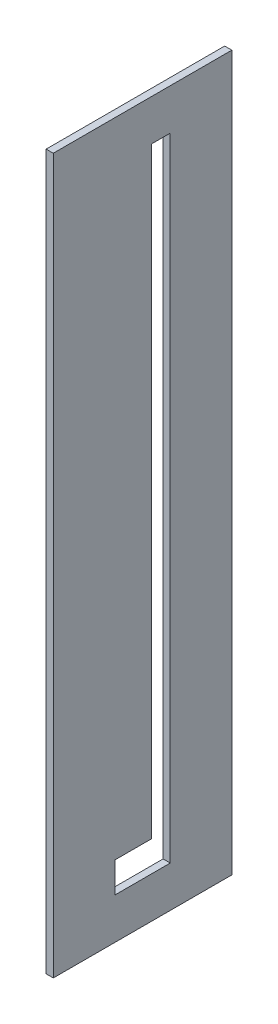
ISO-10303-21;
HEADER;
FILE_DESCRIPTION(('STEP AP214'),'2;1');
FILE_NAME('part.step','',(''),(''),'','','');
FILE_SCHEMA(('AUTOMOTIVE_DESIGN { 1 0 10303 214 1 1 1 1 }'));
ENDSEC;
DATA;
#1=APPLICATION_CONTEXT('core data for automotive mechanical design processes');
#2=APPLICATION_PROTOCOL_DEFINITION('international standard','automotive_design',2000,#1);
#3=PRODUCT_CONTEXT('',#1,'mechanical');
#4=PRODUCT('Part','Part','',(#3));
#5=PRODUCT_RELATED_PRODUCT_CATEGORY('part','',(#4));
#6=PRODUCT_DEFINITION_FORMATION('','',#4);
#7=PRODUCT_DEFINITION_CONTEXT('part definition',#1,'design');
#8=PRODUCT_DEFINITION('design','',#6,#7);
#9=PRODUCT_DEFINITION_SHAPE('','',#8);
#10=(LENGTH_UNIT() NAMED_UNIT(*) SI_UNIT(.MILLI.,.METRE.));
#11=(NAMED_UNIT(*) PLANE_ANGLE_UNIT() SI_UNIT($,.RADIAN.));
#12=(NAMED_UNIT(*) SI_UNIT($,.STERADIAN.) SOLID_ANGLE_UNIT());
#13=UNCERTAINTY_MEASURE_WITH_UNIT(LENGTH_MEASURE(1.E-05),#10,'distance_accuracy_value','');
#14=(GEOMETRIC_REPRESENTATION_CONTEXT(3) GLOBAL_UNCERTAINTY_ASSIGNED_CONTEXT((#13)) GLOBAL_UNIT_ASSIGNED_CONTEXT((#10,
#11,#12)) REPRESENTATION_CONTEXT('',''));
#15=CARTESIAN_POINT('',(0.,0.,0.));
#16=DIRECTION('',(0.,0.,1.));
#17=DIRECTION('',(1.,0.,0.));
#18=AXIS2_PLACEMENT_3D('',#15,#16,#17);
#19=CARTESIAN_POINT('',(4.,377.,15.5000000000001));
#20=DIRECTION('',(0.,0.,-1.));
#21=DIRECTION('',(0.,1.,0.));
#22=AXIS2_PLACEMENT_3D('',#19,#20,#21);
#23=PLANE('',#22);
#24=DIRECTION('',(0.,-1.,0.));
#25=VECTOR('',#24,1.);
#26=CARTESIAN_POINT('',(0.,377.,15.5000000000001));
#27=LINE('',#26,#25);
#28=CARTESIAN_POINT('',(0.,40.,15.5));
#29=VERTEX_POINT('',#28);
#30=CARTESIAN_POINT('',(0.,23.,15.5));
#31=VERTEX_POINT('',#30);
#32=EDGE_CURVE('E149',#29,#31,#27,.T.);
#33=ORIENTED_EDGE('',*,*,#32,.F.);
#34=DIRECTION('',(-1.,0.,0.));
#35=VECTOR('',#34,1.);
#36=CARTESIAN_POINT('',(4.,40.,15.5));
#37=LINE('',#36,#35);
#38=CARTESIAN_POINT('',(4.,40.,15.5));
#39=VERTEX_POINT('',#38);
#40=EDGE_CURVE('E138',#39,#29,#37,.T.);
#41=ORIENTED_EDGE('',*,*,#40,.F.);
#42=DIRECTION('',(0.,-1.,0.));
#43=VECTOR('',#42,1.);
#44=CARTESIAN_POINT('',(4.,377.,15.5000000000001));
#45=LINE('',#44,#43);
#46=CARTESIAN_POINT('',(4.,23.,15.5));
#47=VERTEX_POINT('',#46);
#48=EDGE_CURVE('E127',#39,#47,#45,.T.);
#49=ORIENTED_EDGE('',*,*,#48,.T.);
#50=DIRECTION('',(-1.,0.,0.));
#51=VECTOR('',#50,1.);
#52=CARTESIAN_POINT('',(4.,23.,15.5));
#53=LINE('',#52,#51);
#54=EDGE_CURVE('E171',#47,#31,#53,.T.);
#55=ORIENTED_EDGE('',*,*,#54,.T.);
#56=EDGE_LOOP('',(#33,#41,#49,#55));
#57=FACE_BOUND('',#56,.T.);
#58=ADVANCED_FACE('F33',(#57),#23,.T.);
#59=CARTESIAN_POINT('',(4.,377.,15.5000000000001));
#60=DIRECTION('',(0.,-1.,0.));
#61=DIRECTION('',(0.,0.,-1.));
#62=AXIS2_PLACEMENT_3D('',#59,#60,#61);
#63=PLANE('',#62);
#64=DIRECTION('',(0.,0.,1.));
#65=VECTOR('',#64,1.);
#66=CARTESIAN_POINT('',(4.,377.,15.5000000000001));
#67=LINE('',#66,#65);
#68=CARTESIAN_POINT('',(4.,377.,-15.4999999999999));
#69=VERTEX_POINT('',#68);
#70=CARTESIAN_POINT('',(4.,377.,-4.99999999999987));
#71=VERTEX_POINT('',#70);
#72=EDGE_CURVE('E157',#69,#71,#67,.T.);
#73=ORIENTED_EDGE('',*,*,#72,.T.);
#74=DIRECTION('',(-1.,0.,0.));
#75=VECTOR('',#74,1.);
#76=CARTESIAN_POINT('',(4.,377.,-4.99999999999987));
#77=LINE('',#76,#75);
#78=CARTESIAN_POINT('',(0.,377.,-4.99999999999987));
#79=VERTEX_POINT('',#78);
#80=EDGE_CURVE('E142',#71,#79,#77,.T.);
#81=ORIENTED_EDGE('',*,*,#80,.T.);
#82=DIRECTION('',(0.,0.,1.));
#83=VECTOR('',#82,1.);
#84=CARTESIAN_POINT('',(0.,377.,15.5000000000001));
#85=LINE('',#84,#83);
#86=CARTESIAN_POINT('',(0.,377.,-15.4999999999999));
#87=VERTEX_POINT('',#86);
#88=EDGE_CURVE('E153',#87,#79,#85,.T.);
#89=ORIENTED_EDGE('',*,*,#88,.F.);
#90=DIRECTION('',(-1.,0.,0.));
#91=VECTOR('',#90,1.);
#92=CARTESIAN_POINT('',(4.,377.,-15.4999999999999));
#93=LINE('',#92,#91);
#94=EDGE_CURVE('E48',#69,#87,#93,.T.);
#95=ORIENTED_EDGE('',*,*,#94,.F.);
#96=EDGE_LOOP('',(#73,#81,#89,#95));
#97=FACE_BOUND('',#96,.T.);
#98=ADVANCED_FACE('F218',(#97),#63,.T.);
#99=CARTESIAN_POINT('',(4.,0.,0.));
#100=DIRECTION('',(1.,0.,0.));
#101=DIRECTION('',(0.,0.,-1.));
#102=AXIS2_PLACEMENT_3D('',#99,#100,#101);
#103=PLANE('',#102);
#104=ORIENTED_EDGE('',*,*,#48,.F.);
#105=DIRECTION('',(0.,0.,-1.));
#106=VECTOR('',#105,1.);
#107=CARTESIAN_POINT('',(4.,40.,0.));
#108=LINE('',#107,#106);
#109=CARTESIAN_POINT('',(4.,40.,-4.99999999999987));
#110=VERTEX_POINT('',#109);
#111=EDGE_CURVE('E119',#39,#110,#108,.T.);
#112=ORIENTED_EDGE('',*,*,#111,.T.);
#113=DIRECTION('',(0.,1.,0.));
#114=VECTOR('',#113,1.);
#115=CARTESIAN_POINT('',(4.,0.,-4.99999999999987));
#116=LINE('',#115,#114);
#117=EDGE_CURVE('E124',#110,#71,#116,.T.);
#118=ORIENTED_EDGE('',*,*,#117,.T.);
#119=ORIENTED_EDGE('',*,*,#72,.F.);
#120=DIRECTION('',(0.,1.,0.));
#121=VECTOR('',#120,1.);
#122=CARTESIAN_POINT('',(4.,377.,-15.4999999999999));
#123=LINE('',#122,#121);
#124=CARTESIAN_POINT('',(4.,23.,-15.5));
#125=VERTEX_POINT('',#124);
#126=EDGE_CURVE('E155',#125,#69,#123,.T.);
#127=ORIENTED_EDGE('',*,*,#126,.F.);
#128=DIRECTION('',(0.,0.,-1.));
#129=VECTOR('',#128,1.);
#130=CARTESIAN_POINT('',(4.,23.,15.5));
#131=LINE('',#130,#129);
#132=EDGE_CURVE('E152',#47,#125,#131,.T.);
#133=ORIENTED_EDGE('',*,*,#132,.F.);
#134=EDGE_LOOP('',(#104,#112,#118,#119,#127,#133));
#135=FACE_BOUND('',#134,.T.);
#136=DIRECTION('',(0.,1.,0.));
#137=VECTOR('',#136,1.);
#138=CARTESIAN_POINT('',(4.,400.,-49.9999999999999));
#139=LINE('',#138,#137);
#140=CARTESIAN_POINT('',(4.,0.,-50.));
#141=VERTEX_POINT('',#140);
#142=CARTESIAN_POINT('',(4.,400.,-49.9999999999999));
#143=VERTEX_POINT('',#142);
#144=EDGE_CURVE('E175',#141,#143,#139,.T.);
#145=ORIENTED_EDGE('',*,*,#144,.T.);
#146=DIRECTION('',(0.,0.,1.));
#147=VECTOR('',#146,1.);
#148=CARTESIAN_POINT('',(4.,400.,50.));
#149=LINE('',#148,#147);
#150=CARTESIAN_POINT('',(4.,400.,50.));
#151=VERTEX_POINT('',#150);
#152=EDGE_CURVE('E85',#143,#151,#149,.T.);
#153=ORIENTED_EDGE('',*,*,#152,.T.);
#154=DIRECTION('',(0.,-1.,0.));
#155=VECTOR('',#154,1.);
#156=CARTESIAN_POINT('',(4.,0.,50.));
#157=LINE('',#156,#155);
#158=CARTESIAN_POINT('',(4.,0.,50.));
#159=VERTEX_POINT('',#158);
#160=EDGE_CURVE('E178',#151,#159,#157,.T.);
#161=ORIENTED_EDGE('',*,*,#160,.T.);
#162=DIRECTION('',(0.,0.,-1.));
#163=VECTOR('',#162,1.);
#164=CARTESIAN_POINT('',(4.,0.,50.));
#165=LINE('',#164,#163);
#166=EDGE_CURVE('E57',#159,#141,#165,.T.);
#167=ORIENTED_EDGE('',*,*,#166,.T.);
#168=EDGE_LOOP('',(#145,#153,#161,#167));
#169=FACE_BOUND('',#168,.T.);
#170=ADVANCED_FACE('F121',(#135,#169),#103,.T.);
#171=CARTESIAN_POINT('',(0.,0.,0.));
#172=DIRECTION('',(1.,0.,0.));
#173=DIRECTION('',(0.,0.,-1.));
#174=AXIS2_PLACEMENT_3D('',#171,#172,#173);
#175=PLANE('',#174);
#176=DIRECTION('',(0.,0.,-1.));
#177=VECTOR('',#176,1.);
#178=CARTESIAN_POINT('',(0.,40.,0.));
#179=LINE('',#178,#177);
#180=CARTESIAN_POINT('',(0.,40.,-4.99999999999987));
#181=VERTEX_POINT('',#180);
#182=EDGE_CURVE('E135',#29,#181,#179,.T.);
#183=ORIENTED_EDGE('',*,*,#182,.F.);
#184=ORIENTED_EDGE('',*,*,#32,.T.);
#185=DIRECTION('',(0.,0.,-1.));
#186=VECTOR('',#185,1.);
#187=CARTESIAN_POINT('',(0.,23.,15.5));
#188=LINE('',#187,#186);
#189=CARTESIAN_POINT('',(0.,23.,-15.5));
#190=VERTEX_POINT('',#189);
#191=EDGE_CURVE('E160',#31,#190,#188,.T.);
#192=ORIENTED_EDGE('',*,*,#191,.T.);
#193=DIRECTION('',(0.,1.,0.));
#194=VECTOR('',#193,1.);
#195=CARTESIAN_POINT('',(0.,377.,-15.4999999999999));
#196=LINE('',#195,#194);
#197=EDGE_CURVE('E163',#190,#87,#196,.T.);
#198=ORIENTED_EDGE('',*,*,#197,.T.);
#199=ORIENTED_EDGE('',*,*,#88,.T.);
#200=DIRECTION('',(0.,1.,0.));
#201=VECTOR('',#200,1.);
#202=CARTESIAN_POINT('',(0.,0.,-4.99999999999987));
#203=LINE('',#202,#201);
#204=EDGE_CURVE('E144',#181,#79,#203,.T.);
#205=ORIENTED_EDGE('',*,*,#204,.F.);
#206=EDGE_LOOP('',(#183,#184,#192,#198,#199,#205));
#207=FACE_BOUND('',#206,.T.);
#208=DIRECTION('',(0.,1.,0.));
#209=VECTOR('',#208,1.);
#210=CARTESIAN_POINT('',(0.,400.,-49.9999999999999));
#211=LINE('',#210,#209);
#212=CARTESIAN_POINT('',(0.,0.,-50.));
#213=VERTEX_POINT('',#212);
#214=CARTESIAN_POINT('',(0.,400.,-49.9999999999999));
#215=VERTEX_POINT('',#214);
#216=EDGE_CURVE('E174',#213,#215,#211,.T.);
#217=ORIENTED_EDGE('',*,*,#216,.F.);
#218=DIRECTION('',(0.,0.,-1.));
#219=VECTOR('',#218,1.);
#220=CARTESIAN_POINT('',(0.,0.,50.));
#221=LINE('',#220,#219);
#222=CARTESIAN_POINT('',(0.,0.,50.));
#223=VERTEX_POINT('',#222);
#224=EDGE_CURVE('E78',#223,#213,#221,.T.);
#225=ORIENTED_EDGE('',*,*,#224,.F.);
#226=DIRECTION('',(0.,-1.,0.));
#227=VECTOR('',#226,1.);
#228=CARTESIAN_POINT('',(0.,0.,50.));
#229=LINE('',#228,#227);
#230=CARTESIAN_POINT('',(0.,400.,50.));
#231=VERTEX_POINT('',#230);
#232=EDGE_CURVE('E186',#231,#223,#229,.T.);
#233=ORIENTED_EDGE('',*,*,#232,.F.);
#234=DIRECTION('',(0.,0.,1.));
#235=VECTOR('',#234,1.);
#236=CARTESIAN_POINT('',(0.,400.,50.));
#237=LINE('',#236,#235);
#238=EDGE_CURVE('E184',#215,#231,#237,.T.);
#239=ORIENTED_EDGE('',*,*,#238,.F.);
#240=EDGE_LOOP('',(#217,#225,#233,#239));
#241=FACE_BOUND('',#240,.T.);
#242=ADVANCED_FACE('F199',(#207,#241),#175,.F.);
#243=CARTESIAN_POINT('',(4.,400.,-49.9999999999999));
#244=DIRECTION('',(0.,0.,1.));
#245=DIRECTION('',(0.,-1.,0.));
#246=AXIS2_PLACEMENT_3D('',#243,#244,#245);
#247=PLANE('',#246);
#248=ORIENTED_EDGE('',*,*,#216,.T.);
#249=DIRECTION('',(-1.,0.,0.));
#250=VECTOR('',#249,1.);
#251=CARTESIAN_POINT('',(4.,400.,-49.9999999999999));
#252=LINE('',#251,#250);
#253=EDGE_CURVE('E11',#143,#215,#252,.T.);
#254=ORIENTED_EDGE('',*,*,#253,.F.);
#255=ORIENTED_EDGE('',*,*,#144,.F.);
#256=DIRECTION('',(-1.,0.,0.));
#257=VECTOR('',#256,1.);
#258=CARTESIAN_POINT('',(4.,0.,-50.));
#259=LINE('',#258,#257);
#260=EDGE_CURVE('E181',#141,#213,#259,.T.);
#261=ORIENTED_EDGE('',*,*,#260,.T.);
#262=EDGE_LOOP('',(#248,#254,#255,#261));
#263=FACE_BOUND('',#262,.T.);
#264=ADVANCED_FACE('F35',(#263),#247,.F.);
#265=CARTESIAN_POINT('',(4.,400.,50.));
#266=DIRECTION('',(0.,-1.,0.));
#267=DIRECTION('',(0.,0.,-1.));
#268=AXIS2_PLACEMENT_3D('',#265,#266,#267);
#269=PLANE('',#268);
#270=ORIENTED_EDGE('',*,*,#238,.T.);
#271=DIRECTION('',(-1.,0.,0.));
#272=VECTOR('',#271,1.);
#273=CARTESIAN_POINT('',(4.,400.,50.));
#274=LINE('',#273,#272);
#275=EDGE_CURVE('E41',#151,#231,#274,.T.);
#276=ORIENTED_EDGE('',*,*,#275,.F.);
#277=ORIENTED_EDGE('',*,*,#152,.F.);
#278=ORIENTED_EDGE('',*,*,#253,.T.);
#279=EDGE_LOOP('',(#270,#276,#277,#278));
#280=FACE_BOUND('',#279,.T.);
#281=ADVANCED_FACE('F214',(#280),#269,.F.);
#282=CARTESIAN_POINT('',(4.,0.,50.));
#283=DIRECTION('',(0.,0.,-1.));
#284=DIRECTION('',(-1.,0.,0.));
#285=AXIS2_PLACEMENT_3D('',#282,#283,#284);
#286=PLANE('',#285);
#287=ORIENTED_EDGE('',*,*,#232,.T.);
#288=DIRECTION('',(-1.,0.,0.));
#289=VECTOR('',#288,1.);
#290=CARTESIAN_POINT('',(4.,0.,50.));
#291=LINE('',#290,#289);
#292=EDGE_CURVE('E190',#159,#223,#291,.T.);
#293=ORIENTED_EDGE('',*,*,#292,.F.);
#294=ORIENTED_EDGE('',*,*,#160,.F.);
#295=ORIENTED_EDGE('',*,*,#275,.T.);
#296=EDGE_LOOP('',(#287,#293,#294,#295));
#297=FACE_BOUND('',#296,.T.);
#298=ADVANCED_FACE('F195',(#297),#286,.F.);
#299=CARTESIAN_POINT('',(4.,0.,50.));
#300=DIRECTION('',(0.,1.,0.));
#301=DIRECTION('',(0.,0.,1.));
#302=AXIS2_PLACEMENT_3D('',#299,#300,#301);
#303=PLANE('',#302);
#304=ORIENTED_EDGE('',*,*,#224,.T.);
#305=ORIENTED_EDGE('',*,*,#260,.F.);
#306=ORIENTED_EDGE('',*,*,#166,.F.);
#307=ORIENTED_EDGE('',*,*,#292,.T.);
#308=EDGE_LOOP('',(#304,#305,#306,#307));
#309=FACE_BOUND('',#308,.T.);
#310=ADVANCED_FACE('F203',(#309),#303,.F.);
#311=CARTESIAN_POINT('',(4.,23.,15.5));
#312=DIRECTION('',(0.,1.,0.));
#313=DIRECTION('',(0.,0.,1.));
#314=AXIS2_PLACEMENT_3D('',#311,#312,#313);
#315=PLANE('',#314);
#316=ORIENTED_EDGE('',*,*,#191,.F.);
#317=ORIENTED_EDGE('',*,*,#54,.F.);
#318=ORIENTED_EDGE('',*,*,#132,.T.);
#319=DIRECTION('',(-1.,0.,0.));
#320=VECTOR('',#319,1.);
#321=CARTESIAN_POINT('',(4.,23.,-15.5));
#322=LINE('',#321,#320);
#323=EDGE_CURVE('E169',#125,#190,#322,.T.);
#324=ORIENTED_EDGE('',*,*,#323,.T.);
#325=EDGE_LOOP('',(#316,#317,#318,#324));
#326=FACE_BOUND('',#325,.T.);
#327=ADVANCED_FACE('F205',(#326),#315,.T.);
#328=CARTESIAN_POINT('',(4.,377.,-15.4999999999999));
#329=DIRECTION('',(0.,0.,1.));
#330=DIRECTION('',(0.,-1.,0.));
#331=AXIS2_PLACEMENT_3D('',#328,#329,#330);
#332=PLANE('',#331);
#333=ORIENTED_EDGE('',*,*,#197,.F.);
#334=ORIENTED_EDGE('',*,*,#323,.F.);
#335=ORIENTED_EDGE('',*,*,#126,.T.);
#336=ORIENTED_EDGE('',*,*,#94,.T.);
#337=EDGE_LOOP('',(#333,#334,#335,#336));
#338=FACE_BOUND('',#337,.T.);
#339=ADVANCED_FACE('F211',(#338),#332,.T.);
#340=CARTESIAN_POINT('',(4.,0.,-4.99999999999987));
#341=DIRECTION('',(0.,0.,1.));
#342=DIRECTION('',(1.,0.,0.));
#343=AXIS2_PLACEMENT_3D('',#340,#341,#342);
#344=PLANE('',#343);
#345=ORIENTED_EDGE('',*,*,#204,.T.);
#346=ORIENTED_EDGE('',*,*,#80,.F.);
#347=ORIENTED_EDGE('',*,*,#117,.F.);
#348=DIRECTION('',(-1.,0.,0.));
#349=VECTOR('',#348,1.);
#350=CARTESIAN_POINT('',(4.,40.,-4.99999999999987));
#351=LINE('',#350,#349);
#352=EDGE_CURVE('E130',#110,#181,#351,.T.);
#353=ORIENTED_EDGE('',*,*,#352,.T.);
#354=EDGE_LOOP('',(#345,#346,#347,#353));
#355=FACE_BOUND('',#354,.T.);
#356=ADVANCED_FACE('F140',(#355),#344,.F.);
#357=CARTESIAN_POINT('',(4.,40.,0.));
#358=DIRECTION('',(0.,1.,0.));
#359=DIRECTION('',(0.,0.,1.));
#360=AXIS2_PLACEMENT_3D('',#357,#358,#359);
#361=PLANE('',#360);
#362=ORIENTED_EDGE('',*,*,#182,.T.);
#363=ORIENTED_EDGE('',*,*,#352,.F.);
#364=ORIENTED_EDGE('',*,*,#111,.F.);
#365=ORIENTED_EDGE('',*,*,#40,.T.);
#366=EDGE_LOOP('',(#362,#363,#364,#365));
#367=FACE_BOUND('',#366,.T.);
#368=ADVANCED_FACE('F133',(#367),#361,.F.);
#369=CLOSED_SHELL('',(#58,#98,#170,#242,#264,#281,#298,#310,#327,#339,#356,#368));
#370=MANIFOLD_SOLID_BREP('B2',#369);
#371=ADVANCED_BREP_SHAPE_REPRESENTATION('',(#18,#370),#14);
#372=SHAPE_DEFINITION_REPRESENTATION(#9,#371);
ENDSEC;
END-ISO-10303-21;
